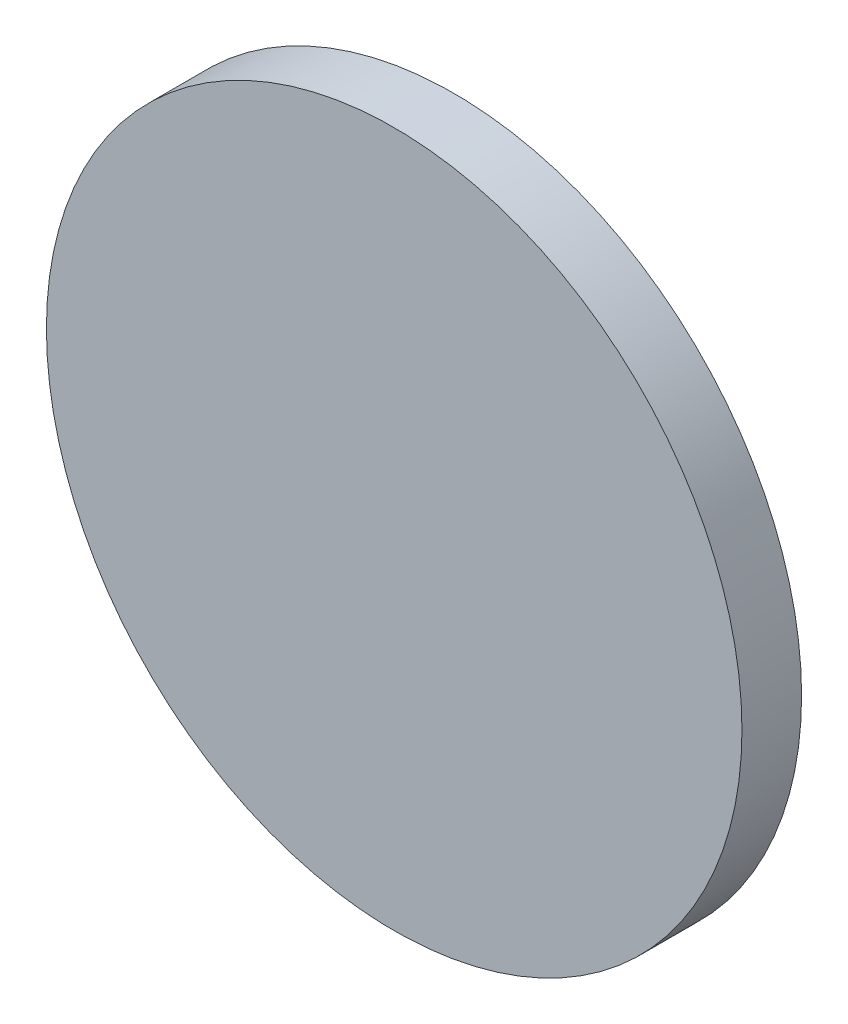
ISO-10303-21;
HEADER;
FILE_DESCRIPTION(('STEP AP214'),'2;1');
FILE_NAME('part.step','',(''),(''),'','','');
FILE_SCHEMA(('AUTOMOTIVE_DESIGN { 1 0 10303 214 1 1 1 1 }'));
ENDSEC;
DATA;
#1=APPLICATION_CONTEXT('core data for automotive mechanical design processes');
#2=APPLICATION_PROTOCOL_DEFINITION('international standard','automotive_design',2000,#1);
#3=PRODUCT_CONTEXT('',#1,'mechanical');
#4=PRODUCT('Part','Part','',(#3));
#5=PRODUCT_RELATED_PRODUCT_CATEGORY('part','',(#4));
#6=PRODUCT_DEFINITION_FORMATION('','',#4);
#7=PRODUCT_DEFINITION_CONTEXT('part definition',#1,'design');
#8=PRODUCT_DEFINITION('design','',#6,#7);
#9=PRODUCT_DEFINITION_SHAPE('','',#8);
#10=(LENGTH_UNIT() NAMED_UNIT(*) SI_UNIT(.MILLI.,.METRE.));
#11=(NAMED_UNIT(*) PLANE_ANGLE_UNIT() SI_UNIT($,.RADIAN.));
#12=(NAMED_UNIT(*) SI_UNIT($,.STERADIAN.) SOLID_ANGLE_UNIT());
#13=UNCERTAINTY_MEASURE_WITH_UNIT(LENGTH_MEASURE(1.E-05),#10,'distance_accuracy_value','');
#14=(GEOMETRIC_REPRESENTATION_CONTEXT(3) GLOBAL_UNCERTAINTY_ASSIGNED_CONTEXT((#13)) GLOBAL_UNIT_ASSIGNED_CONTEXT((#10,
#11,#12)) REPRESENTATION_CONTEXT('',''));
#15=CARTESIAN_POINT('',(0.,0.,0.));
#16=DIRECTION('',(0.,0.,1.));
#17=DIRECTION('',(1.,0.,0.));
#18=AXIS2_PLACEMENT_3D('',#15,#16,#17);
#19=CARTESIAN_POINT('',(8.084,9.76,0.76487));
#20=DIRECTION('',(0.,0.,-1.));
#21=DIRECTION('',(-1.,0.,0.));
#22=AXIS2_PLACEMENT_3D('',#19,#20,#21);
#23=PLANE('',#22);
#24=CARTESIAN_POINT('',(8.084,9.76,0.76487));
#25=DIRECTION('',(0.,0.,1.));
#26=DIRECTION('',(1.,0.,0.));
#27=AXIS2_PLACEMENT_3D('',#24,#25,#26);
#28=CIRCLE('',#27,0.200024667);
#29=CARTESIAN_POINT('',(8.284024667,9.76,0.76487));
#30=VERTEX_POINT('',#29);
#31=EDGE_CURVE('E18',#30,#30,#28,.T.);
#32=ORIENTED_EDGE('',*,*,#31,.F.);
#33=EDGE_LOOP('',(#32));
#34=FACE_BOUND('',#33,.T.);
#35=ADVANCED_FACE('F15',(#34),#23,.T.);
#36=CARTESIAN_POINT('',(8.084,9.76,0.76487));
#37=DIRECTION('',(0.,0.,1.));
#38=DIRECTION('',(1.,0.,0.));
#39=AXIS2_PLACEMENT_3D('',#36,#37,#38);
#40=CYLINDRICAL_SURFACE('',#39,0.200024667);
#41=CARTESIAN_POINT('',(8.084,9.76,0.79916));
#42=DIRECTION('',(0.,0.,1.));
#43=DIRECTION('',(1.,0.,0.));
#44=AXIS2_PLACEMENT_3D('',#41,#42,#43);
#45=CIRCLE('',#44,0.200024667);
#46=CARTESIAN_POINT('',(8.284024667,9.76,0.79916));
#47=VERTEX_POINT('',#46);
#48=EDGE_CURVE('E10',#47,#47,#45,.T.);
#49=ORIENTED_EDGE('',*,*,#48,.F.);
#50=EDGE_LOOP('',(#49));
#51=FACE_BOUND('',#50,.T.);
#52=ORIENTED_EDGE('',*,*,#31,.T.);
#53=EDGE_LOOP('',(#52));
#54=FACE_BOUND('',#53,.T.);
#55=ADVANCED_FACE('F27',(#51,#54),#40,.T.);
#56=CARTESIAN_POINT('',(8.084,9.76,0.79916));
#57=DIRECTION('',(0.,0.,1.));
#58=DIRECTION('',(1.,0.,0.));
#59=AXIS2_PLACEMENT_3D('',#56,#57,#58);
#60=PLANE('',#59);
#61=ORIENTED_EDGE('',*,*,#48,.T.);
#62=EDGE_LOOP('',(#61));
#63=FACE_BOUND('',#62,.T.);
#64=ADVANCED_FACE('F34',(#63),#60,.T.);
#65=CLOSED_SHELL('',(#35,#55,#64));
#66=MANIFOLD_SOLID_BREP('B1',#65);
#67=ADVANCED_BREP_SHAPE_REPRESENTATION('',(#18,#66),#14);
#68=SHAPE_DEFINITION_REPRESENTATION(#9,#67);
ENDSEC;
END-ISO-10303-21;
